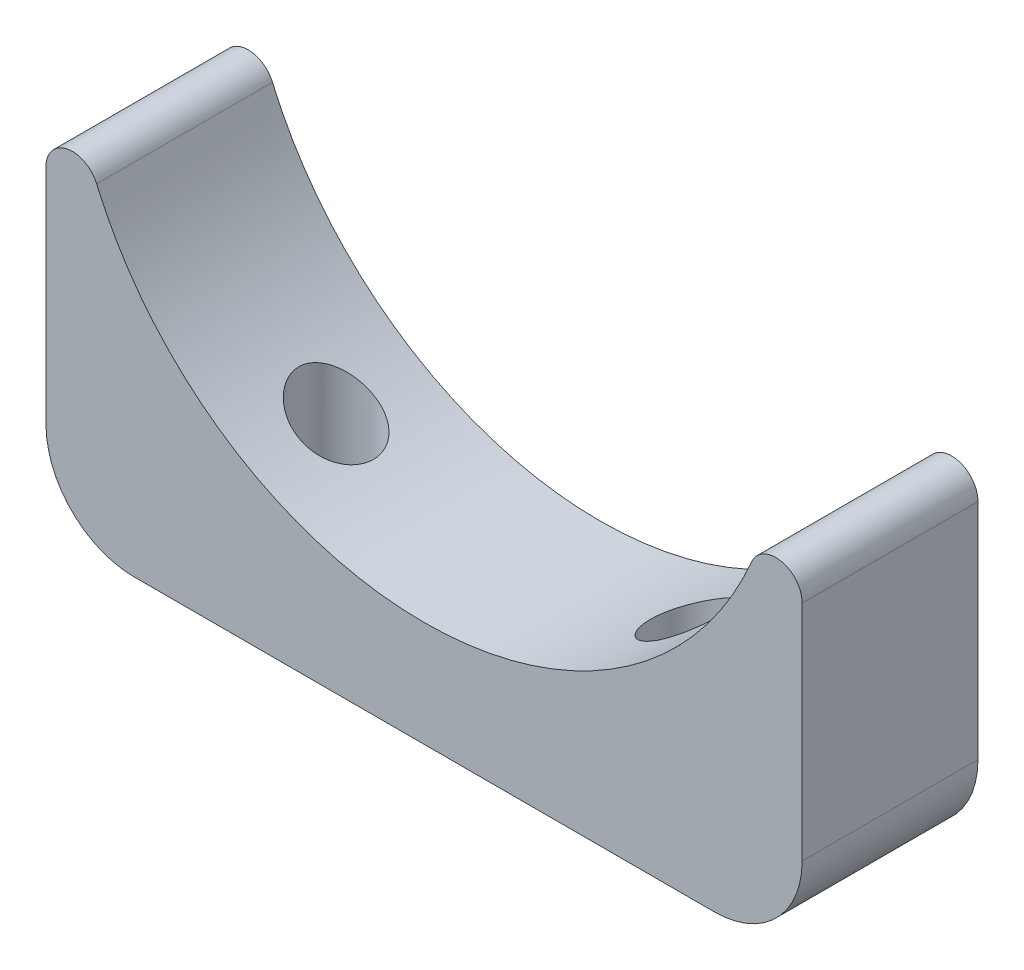
ISO-10303-21;
HEADER;
FILE_DESCRIPTION(('STEP AP214'),'2;1');
FILE_NAME('part.step','',(''),(''),'','','');
FILE_SCHEMA(('AUTOMOTIVE_DESIGN { 1 0 10303 214 1 1 1 1 }'));
ENDSEC;
DATA;
#1=APPLICATION_CONTEXT('core data for automotive mechanical design processes');
#2=APPLICATION_PROTOCOL_DEFINITION('international standard','automotive_design',2000,#1);
#3=PRODUCT_CONTEXT('',#1,'mechanical');
#4=PRODUCT('Part','Part','',(#3));
#5=PRODUCT_RELATED_PRODUCT_CATEGORY('part','',(#4));
#6=PRODUCT_DEFINITION_FORMATION('','',#4);
#7=PRODUCT_DEFINITION_CONTEXT('part definition',#1,'design');
#8=PRODUCT_DEFINITION('design','',#6,#7);
#9=PRODUCT_DEFINITION_SHAPE('','',#8);
#10=(LENGTH_UNIT() NAMED_UNIT(*) SI_UNIT(.MILLI.,.METRE.));
#11=(NAMED_UNIT(*) PLANE_ANGLE_UNIT() SI_UNIT($,.RADIAN.));
#12=(NAMED_UNIT(*) SI_UNIT($,.STERADIAN.) SOLID_ANGLE_UNIT());
#13=UNCERTAINTY_MEASURE_WITH_UNIT(LENGTH_MEASURE(1.E-05),#10,'distance_accuracy_value','');
#14=(GEOMETRIC_REPRESENTATION_CONTEXT(3) GLOBAL_UNCERTAINTY_ASSIGNED_CONTEXT((#13)) GLOBAL_UNIT_ASSIGNED_CONTEXT((#10,
#11,#12)) REPRESENTATION_CONTEXT('',''));
#15=CARTESIAN_POINT('',(0.,0.,0.));
#16=DIRECTION('',(0.,0.,1.));
#17=DIRECTION('',(1.,0.,0.));
#18=AXIS2_PLACEMENT_3D('',#15,#16,#17);
#19=CARTESIAN_POINT('',(40.,-17.0953209972788,10.));
#20=DIRECTION('',(0.,0.,-1.));
#21=DIRECTION('',(-1.,0.,0.));
#22=AXIS2_PLACEMENT_3D('',#19,#20,#21);
#23=CYLINDRICAL_SURFACE('',#22,3.);
#24=CARTESIAN_POINT('',(40.,-17.0953209972788,-10.));
#25=DIRECTION('',(0.,0.,1.));
#26=DIRECTION('',(-1.,0.,0.));
#27=AXIS2_PLACEMENT_3D('',#24,#25,#26);
#28=CIRCLE('',#27,3.);
#29=CARTESIAN_POINT('',(43.,-17.0953209972788,-10.));
#30=VERTEX_POINT('',#29);
#31=CARTESIAN_POINT('',(37.2413793103449,-15.916333342294,-10.));
#32=VERTEX_POINT('',#31);
#33=EDGE_CURVE('E120',#30,#32,#28,.T.);
#34=ORIENTED_EDGE('',*,*,#33,.T.);
#35=DIRECTION('',(0.,0.,-1.));
#36=VECTOR('',#35,1.);
#37=CARTESIAN_POINT('',(37.2413793103449,-15.916333342294,10.));
#38=LINE('',#37,#36);
#39=CARTESIAN_POINT('',(37.2413793103449,-15.916333342294,10.));
#40=VERTEX_POINT('',#39);
#41=EDGE_CURVE('E11',#40,#32,#38,.T.);
#42=ORIENTED_EDGE('',*,*,#41,.F.);
#43=CARTESIAN_POINT('',(40.,-17.0953209972788,10.));
#44=DIRECTION('',(0.,0.,1.));
#45=DIRECTION('',(-1.,0.,0.));
#46=AXIS2_PLACEMENT_3D('',#43,#44,#45);
#47=CIRCLE('',#46,3.);
#48=CARTESIAN_POINT('',(43.,-17.0953209972788,10.));
#49=VERTEX_POINT('',#48);
#50=EDGE_CURVE('E156',#49,#40,#47,.T.);
#51=ORIENTED_EDGE('',*,*,#50,.F.);
#52=DIRECTION('',(0.,0.,-1.));
#53=VECTOR('',#52,1.);
#54=CARTESIAN_POINT('',(43.,-17.0953209972788,10.));
#55=LINE('',#54,#53);
#56=EDGE_CURVE('E133',#49,#30,#55,.T.);
#57=ORIENTED_EDGE('',*,*,#56,.T.);
#58=EDGE_LOOP('',(#34,#42,#51,#57));
#59=FACE_BOUND('',#58,.T.);
#60=ADVANCED_FACE('F47',(#59),#23,.T.);
#61=CARTESIAN_POINT('',(0.,0.,10.));
#62=DIRECTION('',(0.,0.,-1.));
#63=DIRECTION('',(-1.,0.,0.));
#64=AXIS2_PLACEMENT_3D('',#61,#62,#63);
#65=CYLINDRICAL_SURFACE('',#64,40.5);
#66=CARTESIAN_POINT('',(-20.,-35.2171833058807,-4.24999999999998));
#67=CARTESIAN_POINT('',(-19.74395440214,-35.3625890238735,-4.24998505623619));
#68=CARTESIAN_POINT('',(-19.4861939726731,-35.5052418883927,-4.2268175341942));
#69=CARTESIAN_POINT('',(-19.10259929151,-35.7122114844345,-4.15621705969951));
#70=CARTESIAN_POINT('',(-18.9751717962436,-35.780068975441,-4.12668219470962));
#71=CARTESIAN_POINT('',(-18.7222973668516,-35.9130326366279,-4.05551505082106));
#72=CARTESIAN_POINT('',(-18.5968495954137,-35.9781399906209,-4.01388803911306));
#73=CARTESIAN_POINT('',(-18.3483236385819,-36.1055209562572,-3.91820084196536));
#74=CARTESIAN_POINT('',(-18.225262263197,-36.1677770293987,-3.86407358921875));
#75=CARTESIAN_POINT('',(-17.9834687821376,-36.2886084455619,-3.74357254617061));
#76=CARTESIAN_POINT('',(-17.8647346881506,-36.3471854882185,-3.67720446749656));
#77=CARTESIAN_POINT('',(-17.6328332961608,-36.4602500337898,-3.53237984546576));
#78=CARTESIAN_POINT('',(-17.5196652278339,-36.5147381031601,-3.45392498113584));
#79=CARTESIAN_POINT('',(-17.3002276869249,-36.6192147327547,-3.2852508280471));
#80=CARTESIAN_POINT('',(-17.1939573435808,-36.6692038612299,-3.19503302857253));
#81=CARTESIAN_POINT('',(-16.9997232843403,-36.7596210339303,-3.0127720362289));
#82=CARTESIAN_POINT('',(-16.9109866383288,-36.8005059204386,-2.92177801476572));
#83=CARTESIAN_POINT('',(-16.7412506656802,-36.8780318259008,-2.73117773923092));
#84=CARTESIAN_POINT('',(-16.6602503655144,-36.9146733789522,-2.63157257178471));
#85=CARTESIAN_POINT('',(-16.5070037624726,-36.9834541608943,-2.42447171752814));
#86=CARTESIAN_POINT('',(-16.4347528798997,-37.015595746585,-2.31698020638829));
#87=CARTESIAN_POINT('',(-16.2998875785091,-37.0751817770741,-2.09488456174904));
#88=CARTESIAN_POINT('',(-16.2372722364303,-37.1026266719296,-1.98028111118195));
#89=CARTESIAN_POINT('',(-16.1284229094977,-37.1500622952512,-1.75704007495615));
#90=CARTESIAN_POINT('',(-16.0811665363161,-37.1705293271698,-1.6490007797894));
#91=CARTESIAN_POINT('',(-15.9956178325904,-37.2074237540711,-1.42876692811419));
#92=CARTESIAN_POINT('',(-15.957324668621,-37.2238515246433,-1.31657275906249));
#93=CARTESIAN_POINT('',(-15.8901552578938,-37.2525744272039,-1.08892437303463));
#94=CARTESIAN_POINT('',(-15.8612759157607,-37.2648709176469,-0.973471241239085));
#95=CARTESIAN_POINT('',(-15.8132596835711,-37.2852719029285,-0.740192236032411));
#96=CARTESIAN_POINT('',(-15.7941224650357,-37.2933765391057,-0.622366442760531));
#97=CARTESIAN_POINT('',(-15.7666925220528,-37.304981073502,-0.392626262325763));
#98=CARTESIAN_POINT('',(-15.7578038880503,-37.3087340850815,-0.280795343152427));
#99=CARTESIAN_POINT('',(-15.7488980894205,-37.3124943322092,-0.0566786575183681));
#100=CARTESIAN_POINT('',(-15.7488838478077,-37.3125003335809,0.055607246625814));
#101=CARTESIAN_POINT('',(-15.7577325783187,-37.3087642063487,0.279706740377002));
#102=CARTESIAN_POINT('',(-15.7665909493176,-37.305024020428,0.391520544623486));
#103=CARTESIAN_POINT('',(-15.7930881099519,-37.2938141587165,0.613955670392878));
#104=CARTESIAN_POINT('',(-15.8107301362117,-37.2863431081638,0.724576536976514));
#105=CARTESIAN_POINT('',(-15.8542224858001,-37.2678705600126,0.941853492127789));
#106=CARTESIAN_POINT('',(-15.8799230685208,-37.2569334307906,1.04854509328952));
#107=CARTESIAN_POINT('',(-15.9393697015026,-37.2315395540741,1.25927405452863));
#108=CARTESIAN_POINT('',(-15.9731186272537,-37.2170815486113,1.36331045122168));
#109=CARTESIAN_POINT('',(-16.0483092741237,-37.1847205482754,1.56796696126055));
#110=CARTESIAN_POINT('',(-16.0897482204966,-37.1668187959047,1.66858829140342));
#111=CARTESIAN_POINT('',(-16.1799415963782,-37.1276434413568,1.86585713553003));
#112=CARTESIAN_POINT('',(-16.228698767548,-37.1063685753251,1.96250314285794));
#113=CARTESIAN_POINT('',(-16.3342219286343,-37.0600402438159,2.15330259648488));
#114=CARTESIAN_POINT('',(-16.3911412307743,-37.0349135987179,2.24735360306419));
#115=CARTESIAN_POINT('',(-16.5116026764312,-36.9813646337343,2.43014102192111));
#116=CARTESIAN_POINT('',(-16.5751472168125,-36.9529411206937,2.51887549238459));
#117=CARTESIAN_POINT('',(-16.774847252706,-36.8629320876235,2.77632158934371));
#118=CARTESIAN_POINT('',(-16.9201555667497,-36.796570510576,2.93643058909344));
#119=CARTESIAN_POINT('',(-17.2393172509719,-36.6481741163969,3.23919983268203));
#120=CARTESIAN_POINT('',(-17.4143536914102,-36.5654423224108,3.38025807105352));
#121=CARTESIAN_POINT('',(-17.7804309824829,-36.3888387841748,3.63115446039792));
#122=CARTESIAN_POINT('',(-17.9714772859079,-36.2949632399094,3.74098191808483));
#123=CARTESIAN_POINT('',(-18.3821276164641,-36.0888457107393,3.93718187718143));
#124=CARTESIAN_POINT('',(-18.6027449289808,-35.9757090982504,4.02048698812593));
#125=CARTESIAN_POINT('',(-19.0502985937808,-35.7407347173987,4.14907819926666));
#126=CARTESIAN_POINT('',(-19.2772377018054,-35.6188931170445,4.1943474425422));
#127=CARTESIAN_POINT('',(-19.756723568252,-35.3554024854442,4.25061461454908));
#128=CARTESIAN_POINT('',(-20.0093773732941,-35.213038641485,4.25736155878175));
#129=CARTESIAN_POINT('',(-20.5095647780136,-34.9240793991956,4.22678242241172));
#130=CARTESIAN_POINT('',(-20.7570960935868,-34.777482180151,4.18943709442816));
#131=CARTESIAN_POINT('',(-21.2630933053749,-34.4706535895312,4.06703499319491));
#132=CARTESIAN_POINT('',(-21.5205763897421,-34.3103682058901,3.97803355435199));
#133=CARTESIAN_POINT('',(-22.0166245943879,-33.9941860372325,3.7510161383764));
#134=CARTESIAN_POINT('',(-22.2551721609857,-33.8382934087816,3.61295531647594));
#135=CARTESIAN_POINT('',(-22.5935749507857,-33.6124849937771,3.36977455093395));
#136=CARTESIAN_POINT('',(-22.7035238163137,-33.5382846558216,3.28229303969899));
#137=CARTESIAN_POINT('',(-22.9156405758824,-33.3937094885518,3.09540180491382));
#138=CARTESIAN_POINT('',(-23.0178073933003,-33.3233351889425,2.99599043578566));
#139=CARTESIAN_POINT('',(-23.2129080266143,-33.1877236794104,2.78572085745427));
#140=CARTESIAN_POINT('',(-23.3058599911155,-33.1224764265861,2.67488606210838));
#141=CARTESIAN_POINT('',(-23.4813486206793,-32.9983002651265,2.44212470937549));
#142=CARTESIAN_POINT('',(-23.563890725189,-32.9393680591405,2.32020400249129));
#143=CARTESIAN_POINT('',(-23.7445445126969,-32.8094957213412,2.02024763769346));
#144=CARTESIAN_POINT('',(-23.8377066868212,-32.7417712482475,1.83770901564845));
#145=CARTESIAN_POINT('',(-23.9579322687707,-32.6537893278075,1.55177615798451));
#146=CARTESIAN_POINT('',(-23.9947582034899,-32.6267267258315,1.45443029441258));
#147=CARTESIAN_POINT('',(-24.0614553179639,-32.577570233685,1.25618286800372));
#148=CARTESIAN_POINT('',(-24.0913298156261,-32.5554739732616,1.1552830280606));
#149=CARTESIAN_POINT('',(-24.1438564837936,-32.5165384649438,0.949879001069711));
#150=CARTESIAN_POINT('',(-24.1664587981634,-32.499735522345,0.845355157244669));
#151=CARTESIAN_POINT('',(-24.2037831295462,-32.47194827807,0.634188717287555));
#152=CARTESIAN_POINT('',(-24.2185086572928,-32.4609613841666,0.527547087084133));
#153=CARTESIAN_POINT('',(-24.2398280053544,-32.4450445620421,0.313012786732421));
#154=CARTESIAN_POINT('',(-24.2464225936769,-32.4401140617647,0.205120235711699));
#155=CARTESIAN_POINT('',(-24.2513594152745,-32.4364236095489,-0.0109529664454104));
#156=CARTESIAN_POINT('',(-24.2497023360625,-32.4376631435353,-0.1191335928293));
#157=CARTESIAN_POINT('',(-24.2387443254579,-32.4458520296085,-0.324025515785867));
#158=CARTESIAN_POINT('',(-24.2302236934609,-32.452218495053,-0.420802775402678));
#159=CARTESIAN_POINT('',(-24.206659375351,-32.4697990227012,-0.613123766396427));
#160=CARTESIAN_POINT('',(-24.191613613308,-32.4810146276255,-0.708667095235957));
#161=CARTESIAN_POINT('',(-24.1369847243919,-32.5216558344041,-0.99239463260272));
#162=CARTESIAN_POINT('',(-24.087899427365,-32.5580838603638,-1.17786432129947));
#163=CARTESIAN_POINT('',(-23.9658275577532,-32.6480456203953,-1.54013069567535));
#164=CARTESIAN_POINT('',(-23.8924211251756,-32.7018794080984,-1.71670731893707));
#165=CARTESIAN_POINT('',(-23.725111478869,-32.8234636944202,-2.05465808898191));
#166=CARTESIAN_POINT('',(-23.6312005782636,-32.8912194116386,-2.21602650182358));
#167=CARTESIAN_POINT('',(-23.4112665379366,-33.0481966950869,-2.54363247024861));
#168=CARTESIAN_POINT('',(-23.2825709553579,-33.139102649027,-2.70726036796274));
#169=CARTESIAN_POINT('',(-23.0065188567493,-33.3313431478,-3.01089924929374));
#170=CARTESIAN_POINT('',(-22.8591503199053,-33.4326844024702,-3.15089488290099));
#171=CARTESIAN_POINT('',(-22.5200825195514,-33.662221662384,-3.43053878436546));
#172=CARTESIAN_POINT('',(-22.3252538756494,-33.7918884166661,-3.56519196829484));
#173=CARTESIAN_POINT('',(-21.9189882386505,-34.0568185707479,-3.79934528413361));
#174=CARTESIAN_POINT('',(-21.7075418462971,-34.1920851171092,-3.89882534410987));
#175=CARTESIAN_POINT('',(-21.2525753516253,-34.4768951179739,-4.06911929097064));
#176=CARTESIAN_POINT('',(-21.0078849343179,-34.6266218504203,-4.13651994074894));
#177=CARTESIAN_POINT('',(-20.5093660643242,-34.9242075445479,-4.22696912889761));
#178=CARTESIAN_POINT('',(-20.2555370453849,-35.0720663897202,-4.25001491408277));
#179=CARTESIAN_POINT('',(-20.,-35.2171833058807,-4.24999999999998));
#180=B_SPLINE_CURVE_WITH_KNOTS('',3,(#66,#67,#68,#69,#70,#71,#72,#73,#74,#75,#76,#77,#78,#79,
#80,#81,#82,#83,#84,#85,#86,#87,#88,#89,#90,#91,#92,#93,#94,#95,#96,#97,#98,#99,#100,#101,#102,
#103,#104,#105,#106,#107,#108,#109,#110,#111,#112,#113,#114,#115,#116,#117,#118,#119,#120,#121,
#122,#123,#124,#125,#126,#127,#128,#129,#130,#131,#132,#133,#134,#135,#136,#137,#138,#139,#140,
#141,#142,#143,#144,#145,#146,#147,#148,#149,#150,#151,#152,#153,#154,#155,#156,#157,#158,#159,
#160,#161,#162,#163,#164,#165,#166,#167,#168,#169,#170,#171,#172,#173,#174,#175,#176,#177,#178,
#179),.UNSPECIFIED.,.T.,.F.,(4,2,2,2,2,2,2,2,2,2,2,2,2,2,2,2,2,2,2,2,2,2,2,2,2,2,2,2,2,2,2,2,2,
2,2,2,2,2,2,2,2,2,2,2,2,2,2,2,2,2,2,2,2,2,2,2,4),(0.,0.882290272503593,1.32392861780283,
1.7653748785862,2.20924703202651,2.65291259418809,3.09651658035841,3.54006445705771,
3.94005761437762,4.34000037073113,4.73973287229765,5.13942704830145,5.49802197836076,
5.8565835519606,6.21502710708788,6.57345857563025,6.90978929058532,7.2462307848524,
7.5824978988787,7.91888901330541,8.24936689149603,8.57996301928457,8.91044009109426,
9.24104128154669,9.57895614792028,9.91699369141287,10.5925316461764,11.3082081719206,
12.0241294480069,12.8055864325272,13.5873895645477,14.4540117056667,15.3210122889611,
16.26505262318,17.2099581259608,17.6860820780789,18.1622717813244,18.6375041793884,
19.1124872170216,19.7569070325613,20.0792047810378,20.4013483804237,20.7256556444312,
21.0498182419388,21.3739502183317,21.6980551891255,21.9897763472918,22.2815903829153,
22.8646603561431,23.4583716249907,24.0523058523276,24.7312607101348,25.4106548907737,
26.2175412604402,27.0248873483889,27.9053705827905,28.7859084685876),.UNSPECIFIED.);
#181=CARTESIAN_POINT('',(-20.,-35.2171833058807,-4.24999999999998));
#182=VERTEX_POINT('',#181);
#183=EDGE_CURVE('E50',#182,#182,#180,.T.);
#184=ORIENTED_EDGE('',*,*,#183,.T.);
#185=EDGE_LOOP('',(#184));
#186=FACE_BOUND('',#185,.T.);
#187=CARTESIAN_POINT('',(20.,-35.2171833058807,-4.24999999999998));
#188=CARTESIAN_POINT('',(20.3150237802071,-35.0382688963312,-4.24998968947639));
#189=CARTESIAN_POINT('',(20.6279878498057,-34.8548790428513,-4.21492667351544));
#190=CARTESIAN_POINT('',(21.2384795064413,-34.4862985760389,-4.07761823357861));
#191=CARTESIAN_POINT('',(21.5359677760651,-34.3011046719729,-3.97520992645611));
#192=CARTESIAN_POINT('',(22.0710479296605,-33.9589108475552,-3.721595596873));
#193=CARTESIAN_POINT('',(22.3115664708751,-33.8011610034795,-3.57756575680789));
#194=CARTESIAN_POINT('',(22.7640666028035,-33.4980760219851,-3.24064145886344));
#195=CARTESIAN_POINT('',(22.9761127539024,-33.3527130809764,-3.04786050858541));
#196=CARTESIAN_POINT('',(23.3134673563474,-33.1174171894333,-2.67023840760009));
#197=CARTESIAN_POINT('',(23.4471253033701,-33.0227845823494,-2.49582447890261));
#198=CARTESIAN_POINT('',(23.628229480588,-32.8931954827328,-2.21603724073378));
#199=CARTESIAN_POINT('',(23.685384523106,-32.8520462345882,-2.11970835328322));
#200=CARTESIAN_POINT('',(23.7925660453832,-32.7745048695435,-1.92136270604338));
#201=CARTESIAN_POINT('',(23.8425957070375,-32.7381106298606,-1.81934851356707));
#202=CARTESIAN_POINT('',(23.9352914540356,-32.6704018040963,-1.60913110614886));
#203=CARTESIAN_POINT('',(23.9778829918739,-32.6391388136923,-1.50087826222611));
#204=CARTESIAN_POINT('',(24.0543985713836,-32.582789460715,-1.2798505806321));
#205=CARTESIAN_POINT('',(24.088327428964,-32.5576996665133,-1.16707829601175));
#206=CARTESIAN_POINT('',(24.1468922167891,-32.5142880526382,-0.93795315140283));
#207=CARTESIAN_POINT('',(24.1715347825237,-32.4959614005783,-0.821602912574583));
#208=CARTESIAN_POINT('',(24.2110447017918,-32.4665354914934,-0.586360578441492));
#209=CARTESIAN_POINT('',(24.2259139115001,-32.4554348620922,-0.467468970229765));
#210=CARTESIAN_POINT('',(24.2440982585493,-32.4418526430273,-0.246118550839105));
#211=CARTESIAN_POINT('',(24.2487984390043,-32.4383380352117,-0.143833818292936));
#212=CARTESIAN_POINT('',(24.2507968075799,-32.4368441296456,0.0608841679557194));
#213=CARTESIAN_POINT('',(24.2480927033865,-32.4388665461184,0.16331745783852));
#214=CARTESIAN_POINT('',(24.2353222869114,-32.4484085613893,0.36740856436611));
#215=CARTESIAN_POINT('',(24.2252602532773,-32.4559249654236,0.46906679700939));
#216=CARTESIAN_POINT('',(24.1979522293952,-32.4762896345472,0.670885608385142));
#217=CARTESIAN_POINT('',(24.1807034864639,-32.4891399426435,0.77104559801038));
#218=CARTESIAN_POINT('',(24.1209604712032,-32.5335471293341,1.05659348675573));
#219=CARTESIAN_POINT('',(24.069618579614,-32.5716060845308,1.23922272155059));
#220=CARTESIAN_POINT('',(23.9448600438739,-32.6634293068022,1.59240798194112));
#221=CARTESIAN_POINT('',(23.871438431594,-32.7171971084263,1.76296127966448));
#222=CARTESIAN_POINT('',(23.6974295815234,-32.8434838353881,2.10518334727315));
#223=CARTESIAN_POINT('',(23.5949092424631,-32.9173085405327,2.27538288700605));
#224=CARTESIAN_POINT('',(23.3705468144301,-33.0769786166039,2.59621048617049));
#225=CARTESIAN_POINT('',(23.2486940532876,-33.1628306239393,2.74682765139731));
#226=CARTESIAN_POINT('',(22.9657815812486,-33.3595190460246,3.05243489180269));
#227=CARTESIAN_POINT('',(22.8016042303111,-33.4720819973456,3.20342631558528));
#228=CARTESIAN_POINT('',(22.4554729708824,-33.70527254529,3.47588048913037));
#229=CARTESIAN_POINT('',(22.2735074966795,-33.8259053725837,3.59732384552314));
#230=CARTESIAN_POINT('',(21.8624133062846,-34.093326018165,3.82868363879674));
#231=CARTESIAN_POINT('',(21.6306063853263,-34.2409939850991,3.93285494418691));
#232=CARTESIAN_POINT('',(21.15315711169,-34.5379968572262,4.09837540419444));
#233=CARTESIAN_POINT('',(20.9075067724242,-34.6873326839785,4.1596995602449));
#234=CARTESIAN_POINT('',(20.3849752535595,-34.9971816637523,4.24148996482822));
#235=CARTESIAN_POINT('',(20.1072777683391,-35.1574854890066,4.25776360363213));
#236=CARTESIAN_POINT('',(19.689441675528,-35.3921139542705,4.24093903788044));
#237=CARTESIAN_POINT('',(19.5498592843394,-35.4693992772822,4.22843735927866));
#238=CARTESIAN_POINT('',(19.2713309134997,-35.6214945961453,4.18942504633696));
#239=CARTESIAN_POINT('',(19.1323846488949,-35.6963058182785,4.16292146602844));
#240=CARTESIAN_POINT('',(18.8601790215624,-35.8408532177092,4.09663145932059));
#241=CARTESIAN_POINT('',(18.7268689002731,-35.9106726434545,4.0572344461606));
#242=CARTESIAN_POINT('',(18.4632926079126,-36.0468974031424,3.96491038301639));
#243=CARTESIAN_POINT('',(18.3330249563899,-36.1133044172594,3.91199006969416));
#244=CARTESIAN_POINT('',(18.0768633866054,-36.2422069891675,3.79262532088237));
#245=CARTESIAN_POINT('',(17.9509681964588,-36.3047036887239,3.7261848574379));
#246=CARTESIAN_POINT('',(17.7049768516282,-36.4253010048658,3.57992125846921));
#247=CARTESIAN_POINT('',(17.5848799017396,-36.4834022248962,3.50009996482405));
#248=CARTESIAN_POINT('',(17.3643653999522,-36.5888253096839,3.33657407897545));
#249=CARTESIAN_POINT('',(17.2632110344933,-36.6366370157525,3.25417724413679));
#250=CARTESIAN_POINT('',(17.0679004147436,-36.7280328646738,3.07936067717751));
#251=CARTESIAN_POINT('',(16.9737431568418,-36.771617614083,2.98694238715136));
#252=CARTESIAN_POINT('',(16.793610225443,-36.854232777088,2.79268702577796));
#253=CARTESIAN_POINT('',(16.7076297910013,-36.8932658439268,2.69085550423806));
#254=CARTESIAN_POINT('',(16.5449087419315,-36.9665248484214,2.47845429028949));
#255=CARTESIAN_POINT('',(16.4681670822807,-37.0007513298359,2.36788558851471));
#256=CARTESIAN_POINT('',(16.3330477314367,-37.0605771999218,2.15181815563796));
#257=CARTESIAN_POINT('',(16.2735752107798,-37.0867140802652,2.04715107597108));
#258=CARTESIAN_POINT('',(16.1634124423249,-37.1348584710958,1.83239068068255));
#259=CARTESIAN_POINT('',(16.1127212133855,-37.1568664429323,1.72229797303883));
#260=CARTESIAN_POINT('',(16.0207357097356,-37.1966200013764,1.49756227571427));
#261=CARTESIAN_POINT('',(15.9794377781898,-37.2143672468457,1.38292107725637));
#262=CARTESIAN_POINT('',(15.9067190296233,-37.2455078808315,1.14997225900162));
#263=CARTESIAN_POINT('',(15.8752977309126,-37.2589014816792,1.03166481831908));
#264=CARTESIAN_POINT('',(15.824708734831,-37.2804142851129,0.80141791863756));
#265=CARTESIAN_POINT('',(15.804795242456,-37.2888552528133,0.689671687697391));
#266=CARTESIAN_POINT('',(15.7739540550832,-37.3019122241761,0.464683806368792));
#267=CARTESIAN_POINT('',(15.7630293061313,-37.3065269738056,0.351441678048229));
#268=CARTESIAN_POINT('',(15.7503014639883,-37.3119022776538,0.124421102781649));
#269=CARTESIAN_POINT('',(15.7484931071304,-37.3126650559428,0.0106430032939324));
#270=CARTESIAN_POINT('',(15.7540047554443,-37.3103382903558,-0.216695000914164));
#271=CARTESIAN_POINT('',(15.7613280946152,-37.3072473394761,-0.330254810772464));
#272=CARTESIAN_POINT('',(15.7846682401495,-37.2973779562134,-0.55282718183661));
#273=CARTESIAN_POINT('',(15.8004149801267,-37.2907140629651,-0.661873284212617));
#274=CARTESIAN_POINT('',(15.8402656930372,-37.2738038161219,-0.87818528396323));
#275=CARTESIAN_POINT('',(15.8643726398369,-37.263556187721,-0.985450533611812));
#276=CARTESIAN_POINT('',(15.9206867718435,-37.239530985305,-1.1973804567607));
#277=CARTESIAN_POINT('',(15.9528907016621,-37.2257548298911,-1.3020461568707));
#278=CARTESIAN_POINT('',(16.0250944390972,-37.1947293551675,-1.50816337292589));
#279=CARTESIAN_POINT('',(16.0650971592437,-37.1774787382083,-1.60961367154299));
#280=CARTESIAN_POINT('',(16.1529735217025,-37.1393828868153,-1.80968118250591));
#281=CARTESIAN_POINT('',(16.2009265248534,-37.118501292875,-1.90825666397744));
#282=CARTESIAN_POINT('',(16.3039304696157,-37.073373408958,-2.10083691694883));
#283=CARTESIAN_POINT('',(16.3589839722635,-37.0491259047095,-2.19484002233603));
#284=CARTESIAN_POINT('',(16.5340179164089,-36.9715095525479,-2.46908750852574));
#285=CARTESIAN_POINT('',(16.6639520733645,-36.9132324426993,-2.64175097789234));
#286=CARTESIAN_POINT('',(16.9524965298202,-36.7816414207736,-2.97076949508381));
#287=CARTESIAN_POINT('',(17.1121934893127,-36.7077344274491,-3.12592433820276));
#288=CARTESIAN_POINT('',(17.4502300958254,-36.5482474164512,-3.40728029269035));
#289=CARTESIAN_POINT('',(17.628579182641,-36.4626614813508,-3.53346663894802));
#290=CARTESIAN_POINT('',(18.0139574477153,-36.2739171235183,-3.76467271459765));
#291=CARTESIAN_POINT('',(18.2221381450223,-36.1698888229532,-3.86705416794188));
#292=CARTESIAN_POINT('',(18.6477269409847,-35.9523202988301,-4.03561977422584));
#293=CARTESIAN_POINT('',(18.8651301104543,-35.8387851256322,-4.10182300728498));
#294=CARTESIAN_POINT('',(19.2361739605269,-35.6405572933511,-4.18368891152058));
#295=CARTESIAN_POINT('',(19.3888495154894,-35.5577399638165,-4.20863501557224));
#296=CARTESIAN_POINT('',(19.6945108995543,-35.3893596154671,-4.24179526237473));
#297=CARTESIAN_POINT('',(19.8474967998571,-35.3037958783984,-4.2500049913306));
#298=CARTESIAN_POINT('',(20.,-35.2171833058807,-4.24999999999998));
#299=B_SPLINE_CURVE_WITH_KNOTS('',3,(#187,#188,#189,#190,#191,#192,#193,#194,#195,#196,#197,
#198,#199,#200,#201,#202,#203,#204,#205,#206,#207,#208,#209,#210,#211,#212,#213,#214,#215,#216,
#217,#218,#219,#220,#221,#222,#223,#224,#225,#226,#227,#228,#229,#230,#231,#232,#233,#234,#235,
#236,#237,#238,#239,#240,#241,#242,#243,#244,#245,#246,#247,#248,#249,#250,#251,#252,#253,#254,
#255,#256,#257,#258,#259,#260,#261,#262,#263,#264,#265,#266,#267,#268,#269,#270,#271,#272,#273,
#274,#275,#276,#277,#278,#279,#280,#281,#282,#283,#284,#285,#286,#287,#288,#289,#290,#291,#292,
#293,#294,#295,#296,#297,#298),.UNSPECIFIED.,.T.,.F.,(4,2,2,2,2,2,2,2,2,2,2,2,2,2,2,2,2,2,2,2,2,
2,2,2,2,2,2,2,2,2,2,2,2,2,2,2,2,2,2,2,2,2,2,2,2,2,2,2,2,2,2,2,2,2,2,4),(0.,1.0860469802327,
2.1747304119374,3.1350668084668,4.0931875079527,4.80787662018158,5.16548416003992,
5.52293150332936,5.8837779648188,6.24442337925192,6.60481060482167,6.96512936516016,
7.27208388684035,7.57913345020258,7.88600460559589,8.19299340826473,8.77078936420481,
9.34871542665358,9.98220447996858,10.6160444659472,11.3627706963691,12.1099857136783,
12.9880838744354,13.8666939223825,14.8246948662049,15.3043025725048,15.7836688868704,
16.2497196327555,16.7155386654758,17.181221043659,17.6468393729487,18.063118819657,
18.4793384427558,18.8953142194604,19.3112428997278,19.6803242517016,20.049364339264,
20.4182605117113,20.7871386900563,21.1281784839505,21.4693300086017,21.8102845349512,
22.1513635808888,22.4821105131691,22.812975218591,23.143707112129,23.4745627579561,
23.8089454447712,24.143449077123,24.8118606787116,25.5127528666661,26.2140015069236,
26.973655909154,27.7329092878044,28.2585266792168,28.7842826709777),.UNSPECIFIED.);
#300=CARTESIAN_POINT('',(20.,-35.2171833058807,-4.24999999999998));
#301=VERTEX_POINT('',#300);
#302=EDGE_CURVE('E134',#301,#301,#299,.T.);
#303=ORIENTED_EDGE('',*,*,#302,.T.);
#304=EDGE_LOOP('',(#303));
#305=FACE_BOUND('',#304,.T.);
#306=CARTESIAN_POINT('',(0.,0.,-10.));
#307=DIRECTION('',(0.,0.,-1.));
#308=DIRECTION('',(1.,0.,0.));
#309=AXIS2_PLACEMENT_3D('',#306,#307,#308);
#310=CIRCLE('',#309,40.5);
#311=CARTESIAN_POINT('',(-37.2413793103449,-15.916333342294,-10.));
#312=VERTEX_POINT('',#311);
#313=EDGE_CURVE('E116',#32,#312,#310,.T.);
#314=ORIENTED_EDGE('',*,*,#313,.T.);
#315=DIRECTION('',(0.,0.,-1.));
#316=VECTOR('',#315,1.);
#317=CARTESIAN_POINT('',(-37.2413793103449,-15.916333342294,10.));
#318=LINE('',#317,#316);
#319=CARTESIAN_POINT('',(-37.2413793103449,-15.916333342294,10.));
#320=VERTEX_POINT('',#319);
#321=EDGE_CURVE('E59',#320,#312,#318,.T.);
#322=ORIENTED_EDGE('',*,*,#321,.F.);
#323=CARTESIAN_POINT('',(0.,0.,10.));
#324=DIRECTION('',(0.,0.,-1.));
#325=DIRECTION('',(1.,0.,0.));
#326=AXIS2_PLACEMENT_3D('',#323,#324,#325);
#327=CIRCLE('',#326,40.5);
#328=EDGE_CURVE('E129',#40,#320,#327,.T.);
#329=ORIENTED_EDGE('',*,*,#328,.F.);
#330=ORIENTED_EDGE('',*,*,#41,.T.);
#331=EDGE_LOOP('',(#314,#322,#329,#330));
#332=FACE_BOUND('',#331,.T.);
#333=ADVANCED_FACE('F128',(#186,#305,#332),#65,.F.);
#334=CARTESIAN_POINT('',(-40.,-17.0953209972788,10.));
#335=DIRECTION('',(0.,0.,-1.));
#336=DIRECTION('',(-1.,0.,0.));
#337=AXIS2_PLACEMENT_3D('',#334,#335,#336);
#338=CYLINDRICAL_SURFACE('',#337,3.);
#339=CARTESIAN_POINT('',(-40.,-17.0953209972788,-10.));
#340=DIRECTION('',(0.,0.,1.));
#341=DIRECTION('',(1.,0.,0.));
#342=AXIS2_PLACEMENT_3D('',#339,#340,#341);
#343=CIRCLE('',#342,3.);
#344=CARTESIAN_POINT('',(-43.,-17.0953209972788,-10.));
#345=VERTEX_POINT('',#344);
#346=EDGE_CURVE('E122',#312,#345,#343,.T.);
#347=ORIENTED_EDGE('',*,*,#346,.T.);
#348=DIRECTION('',(0.,0.,-1.));
#349=VECTOR('',#348,1.);
#350=CARTESIAN_POINT('',(-43.,-17.0953209972788,10.));
#351=LINE('',#350,#349);
#352=CARTESIAN_POINT('',(-43.,-17.0953209972788,10.));
#353=VERTEX_POINT('',#352);
#354=EDGE_CURVE('E182',#353,#345,#351,.T.);
#355=ORIENTED_EDGE('',*,*,#354,.F.);
#356=CARTESIAN_POINT('',(-40.,-17.0953209972788,10.));
#357=DIRECTION('',(0.,0.,1.));
#358=DIRECTION('',(1.,0.,0.));
#359=AXIS2_PLACEMENT_3D('',#356,#357,#358);
#360=CIRCLE('',#359,3.);
#361=EDGE_CURVE('E159',#320,#353,#360,.T.);
#362=ORIENTED_EDGE('',*,*,#361,.F.);
#363=ORIENTED_EDGE('',*,*,#321,.T.);
#364=EDGE_LOOP('',(#347,#355,#362,#363));
#365=FACE_BOUND('',#364,.T.);
#366=ADVANCED_FACE('F187',(#365),#338,.T.);
#367=CARTESIAN_POINT('',(-43.,-17.0953209972788,10.));
#368=DIRECTION('',(1.,0.,0.));
#369=DIRECTION('',(0.,1.,0.));
#370=AXIS2_PLACEMENT_3D('',#367,#368,#369);
#371=PLANE('',#370);
#372=DIRECTION('',(0.,-1.,0.));
#373=VECTOR('',#372,1.);
#374=CARTESIAN_POINT('',(-43.,-17.0953209972788,-10.));
#375=LINE('',#374,#373);
#376=CARTESIAN_POINT('',(-43.,-42.5000000000001,-10.));
#377=VERTEX_POINT('',#376);
#378=EDGE_CURVE('E146',#345,#377,#375,.T.);
#379=ORIENTED_EDGE('',*,*,#378,.T.);
#380=DIRECTION('',(0.,0.,-1.));
#381=VECTOR('',#380,1.);
#382=CARTESIAN_POINT('',(-43.,-42.5000000000001,10.));
#383=LINE('',#382,#381);
#384=CARTESIAN_POINT('',(-43.,-42.5000000000001,10.));
#385=VERTEX_POINT('',#384);
#386=EDGE_CURVE('E179',#385,#377,#383,.T.);
#387=ORIENTED_EDGE('',*,*,#386,.F.);
#388=DIRECTION('',(0.,-1.,0.));
#389=VECTOR('',#388,1.);
#390=CARTESIAN_POINT('',(-43.,-17.0953209972788,10.));
#391=LINE('',#390,#389);
#392=EDGE_CURVE('E161',#353,#385,#391,.T.);
#393=ORIENTED_EDGE('',*,*,#392,.F.);
#394=ORIENTED_EDGE('',*,*,#354,.T.);
#395=EDGE_LOOP('',(#379,#387,#393,#394));
#396=FACE_BOUND('',#395,.T.);
#397=ADVANCED_FACE('F195',(#396),#371,.F.);
#398=CARTESIAN_POINT('',(-33.,-42.5,10.));
#399=DIRECTION('',(0.,0.,-1.));
#400=DIRECTION('',(-1.,0.,0.));
#401=AXIS2_PLACEMENT_3D('',#398,#399,#400);
#402=CYLINDRICAL_SURFACE('',#401,10.);
#403=CARTESIAN_POINT('',(-33.,-42.5,-10.));
#404=DIRECTION('',(0.,0.,1.));
#405=DIRECTION('',(1.,0.,0.));
#406=AXIS2_PLACEMENT_3D('',#403,#404,#405);
#407=CIRCLE('',#406,10.);
#408=CARTESIAN_POINT('',(-33.,-52.5000000000001,-10.));
#409=VERTEX_POINT('',#408);
#410=EDGE_CURVE('E148',#377,#409,#407,.T.);
#411=ORIENTED_EDGE('',*,*,#410,.T.);
#412=DIRECTION('',(0.,0.,-1.));
#413=VECTOR('',#412,1.);
#414=CARTESIAN_POINT('',(-33.,-52.5000000000001,10.));
#415=LINE('',#414,#413);
#416=CARTESIAN_POINT('',(-33.,-52.5000000000001,10.));
#417=VERTEX_POINT('',#416);
#418=EDGE_CURVE('E176',#417,#409,#415,.T.);
#419=ORIENTED_EDGE('',*,*,#418,.F.);
#420=CARTESIAN_POINT('',(-33.,-42.5,10.));
#421=DIRECTION('',(0.,0.,1.));
#422=DIRECTION('',(1.,0.,0.));
#423=AXIS2_PLACEMENT_3D('',#420,#421,#422);
#424=CIRCLE('',#423,10.);
#425=EDGE_CURVE('E163',#385,#417,#424,.T.);
#426=ORIENTED_EDGE('',*,*,#425,.F.);
#427=ORIENTED_EDGE('',*,*,#386,.T.);
#428=EDGE_LOOP('',(#411,#419,#426,#427));
#429=FACE_BOUND('',#428,.T.);
#430=ADVANCED_FACE('F198',(#429),#402,.T.);
#431=CARTESIAN_POINT('',(33.,-52.5000000000001,10.));
#432=DIRECTION('',(0.,1.,0.));
#433=DIRECTION('',(-1.,0.,0.));
#434=AXIS2_PLACEMENT_3D('',#431,#432,#433);
#435=PLANE('',#434);
#436=CARTESIAN_POINT('',(-20.,-52.5000000000001,0.));
#437=DIRECTION('',(0.,-1.,0.));
#438=DIRECTION('',(0.,0.,-1.));
#439=AXIS2_PLACEMENT_3D('',#436,#437,#438);
#440=CIRCLE('',#439,4.25);
#441=CARTESIAN_POINT('',(-20.,-52.5000000000001,-4.25));
#442=VERTEX_POINT('',#441);
#443=EDGE_CURVE('E242',#442,#442,#440,.T.);
#444=ORIENTED_EDGE('',*,*,#443,.F.);
#445=EDGE_LOOP('',(#444));
#446=FACE_BOUND('',#445,.T.);
#447=CARTESIAN_POINT('',(20.,-52.5000000000001,0.));
#448=DIRECTION('',(0.,-1.,0.));
#449=DIRECTION('',(0.,0.,-1.));
#450=AXIS2_PLACEMENT_3D('',#447,#448,#449);
#451=CIRCLE('',#450,4.25);
#452=CARTESIAN_POINT('',(20.,-52.5000000000001,-4.25));
#453=VERTEX_POINT('',#452);
#454=EDGE_CURVE('E137',#453,#453,#451,.T.);
#455=ORIENTED_EDGE('',*,*,#454,.F.);
#456=EDGE_LOOP('',(#455));
#457=FACE_BOUND('',#456,.T.);
#458=DIRECTION('',(1.,0.,0.));
#459=VECTOR('',#458,1.);
#460=CARTESIAN_POINT('',(33.,-52.5000000000001,-10.));
#461=LINE('',#460,#459);
#462=CARTESIAN_POINT('',(33.,-52.5000000000001,-10.));
#463=VERTEX_POINT('',#462);
#464=EDGE_CURVE('E150',#409,#463,#461,.T.);
#465=ORIENTED_EDGE('',*,*,#464,.T.);
#466=DIRECTION('',(0.,0.,-1.));
#467=VECTOR('',#466,1.);
#468=CARTESIAN_POINT('',(33.,-52.5000000000001,10.));
#469=LINE('',#468,#467);
#470=CARTESIAN_POINT('',(33.,-52.5000000000001,10.));
#471=VERTEX_POINT('',#470);
#472=EDGE_CURVE('E173',#471,#463,#469,.T.);
#473=ORIENTED_EDGE('',*,*,#472,.F.);
#474=DIRECTION('',(1.,0.,0.));
#475=VECTOR('',#474,1.);
#476=CARTESIAN_POINT('',(33.,-52.5000000000001,10.));
#477=LINE('',#476,#475);
#478=EDGE_CURVE('E165',#417,#471,#477,.T.);
#479=ORIENTED_EDGE('',*,*,#478,.F.);
#480=ORIENTED_EDGE('',*,*,#418,.T.);
#481=EDGE_LOOP('',(#465,#473,#479,#480));
#482=FACE_BOUND('',#481,.T.);
#483=ADVANCED_FACE('F203',(#446,#457,#482),#435,.F.);
#484=CARTESIAN_POINT('',(33.,-42.5,10.));
#485=DIRECTION('',(0.,0.,-1.));
#486=DIRECTION('',(-1.,0.,0.));
#487=AXIS2_PLACEMENT_3D('',#484,#485,#486);
#488=CYLINDRICAL_SURFACE('',#487,10.);
#489=CARTESIAN_POINT('',(33.,-42.5,-10.));
#490=DIRECTION('',(0.,0.,1.));
#491=DIRECTION('',(-1.,0.,0.));
#492=AXIS2_PLACEMENT_3D('',#489,#490,#491);
#493=CIRCLE('',#492,10.);
#494=CARTESIAN_POINT('',(43.,-42.5,-10.));
#495=VERTEX_POINT('',#494);
#496=EDGE_CURVE('E152',#463,#495,#493,.T.);
#497=ORIENTED_EDGE('',*,*,#496,.T.);
#498=DIRECTION('',(0.,0.,-1.));
#499=VECTOR('',#498,1.);
#500=CARTESIAN_POINT('',(43.,-42.5,10.));
#501=LINE('',#500,#499);
#502=CARTESIAN_POINT('',(43.,-42.5,10.));
#503=VERTEX_POINT('',#502);
#504=EDGE_CURVE('E170',#503,#495,#501,.T.);
#505=ORIENTED_EDGE('',*,*,#504,.F.);
#506=CARTESIAN_POINT('',(33.,-42.5,10.));
#507=DIRECTION('',(0.,0.,1.));
#508=DIRECTION('',(-1.,0.,0.));
#509=AXIS2_PLACEMENT_3D('',#506,#507,#508);
#510=CIRCLE('',#509,10.);
#511=EDGE_CURVE('E71',#471,#503,#510,.T.);
#512=ORIENTED_EDGE('',*,*,#511,.F.);
#513=ORIENTED_EDGE('',*,*,#472,.T.);
#514=EDGE_LOOP('',(#497,#505,#512,#513));
#515=FACE_BOUND('',#514,.T.);
#516=ADVANCED_FACE('F206',(#515),#488,.T.);
#517=CARTESIAN_POINT('',(43.,-17.0953209972788,10.));
#518=DIRECTION('',(-1.,0.,0.));
#519=DIRECTION('',(0.,0.,1.));
#520=AXIS2_PLACEMENT_3D('',#517,#518,#519);
#521=PLANE('',#520);
#522=DIRECTION('',(0.,1.,0.));
#523=VECTOR('',#522,1.);
#524=CARTESIAN_POINT('',(43.,-17.0953209972788,-10.));
#525=LINE('',#524,#523);
#526=EDGE_CURVE('E154',#495,#30,#525,.T.);
#527=ORIENTED_EDGE('',*,*,#526,.T.);
#528=ORIENTED_EDGE('',*,*,#56,.F.);
#529=DIRECTION('',(0.,1.,0.));
#530=VECTOR('',#529,1.);
#531=CARTESIAN_POINT('',(43.,-17.0953209972788,10.));
#532=LINE('',#531,#530);
#533=EDGE_CURVE('E66',#503,#49,#532,.T.);
#534=ORIENTED_EDGE('',*,*,#533,.F.);
#535=ORIENTED_EDGE('',*,*,#504,.T.);
#536=EDGE_LOOP('',(#527,#528,#534,#535));
#537=FACE_BOUND('',#536,.T.);
#538=ADVANCED_FACE('F208',(#537),#521,.F.);
#539=CARTESIAN_POINT('',(40.,-17.0953209972788,10.));
#540=DIRECTION('',(0.,0.,-1.));
#541=DIRECTION('',(-1.,0.,0.));
#542=AXIS2_PLACEMENT_3D('',#539,#540,#541);
#543=PLANE('',#542);
#544=ORIENTED_EDGE('',*,*,#50,.T.);
#545=ORIENTED_EDGE('',*,*,#328,.T.);
#546=ORIENTED_EDGE('',*,*,#361,.T.);
#547=ORIENTED_EDGE('',*,*,#392,.T.);
#548=ORIENTED_EDGE('',*,*,#425,.T.);
#549=ORIENTED_EDGE('',*,*,#478,.T.);
#550=ORIENTED_EDGE('',*,*,#511,.T.);
#551=ORIENTED_EDGE('',*,*,#533,.T.);
#552=EDGE_LOOP('',(#544,#545,#546,#547,#548,#549,#550,#551));
#553=FACE_BOUND('',#552,.T.);
#554=ADVANCED_FACE('F190',(#553),#543,.F.);
#555=CARTESIAN_POINT('',(40.,-17.0953209972788,-10.));
#556=DIRECTION('',(0.,0.,-1.));
#557=DIRECTION('',(-1.,0.,0.));
#558=AXIS2_PLACEMENT_3D('',#555,#556,#557);
#559=PLANE('',#558);
#560=ORIENTED_EDGE('',*,*,#33,.F.);
#561=ORIENTED_EDGE('',*,*,#526,.F.);
#562=ORIENTED_EDGE('',*,*,#496,.F.);
#563=ORIENTED_EDGE('',*,*,#464,.F.);
#564=ORIENTED_EDGE('',*,*,#410,.F.);
#565=ORIENTED_EDGE('',*,*,#378,.F.);
#566=ORIENTED_EDGE('',*,*,#346,.F.);
#567=ORIENTED_EDGE('',*,*,#313,.F.);
#568=EDGE_LOOP('',(#560,#561,#562,#563,#564,#565,#566,#567));
#569=FACE_BOUND('',#568,.T.);
#570=ADVANCED_FACE('F117',(#569),#559,.T.);
#571=CARTESIAN_POINT('',(20.,-52.5000000000001,0.));
#572=DIRECTION('',(0.,-1.,0.));
#573=DIRECTION('',(0.,0.,-1.));
#574=AXIS2_PLACEMENT_3D('',#571,#572,#573);
#575=CYLINDRICAL_SURFACE('',#574,4.25);
#576=ORIENTED_EDGE('',*,*,#454,.T.);
#577=EDGE_LOOP('',(#576));
#578=FACE_BOUND('',#577,.T.);
#579=ORIENTED_EDGE('',*,*,#302,.F.);
#580=EDGE_LOOP('',(#579));
#581=FACE_BOUND('',#580,.T.);
#582=ADVANCED_FACE('F251',(#578,#581),#575,.F.);
#583=CARTESIAN_POINT('',(-20.,-52.5000000000001,0.));
#584=DIRECTION('',(0.,-1.,0.));
#585=DIRECTION('',(0.,0.,-1.));
#586=AXIS2_PLACEMENT_3D('',#583,#584,#585);
#587=CYLINDRICAL_SURFACE('',#586,4.25);
#588=ORIENTED_EDGE('',*,*,#443,.T.);
#589=EDGE_LOOP('',(#588));
#590=FACE_BOUND('',#589,.T.);
#591=ORIENTED_EDGE('',*,*,#183,.F.);
#592=EDGE_LOOP('',(#591));
#593=FACE_BOUND('',#592,.T.);
#594=ADVANCED_FACE('F248',(#590,#593),#587,.F.);
#595=CLOSED_SHELL('',(#60,#333,#366,#397,#430,#483,#516,#538,#554,#570,#582,#594));
#596=MANIFOLD_SOLID_BREP('B2',#595);
#597=ADVANCED_BREP_SHAPE_REPRESENTATION('',(#18,#596),#14);
#598=SHAPE_DEFINITION_REPRESENTATION(#9,#597);
ENDSEC;
END-ISO-10303-21;
